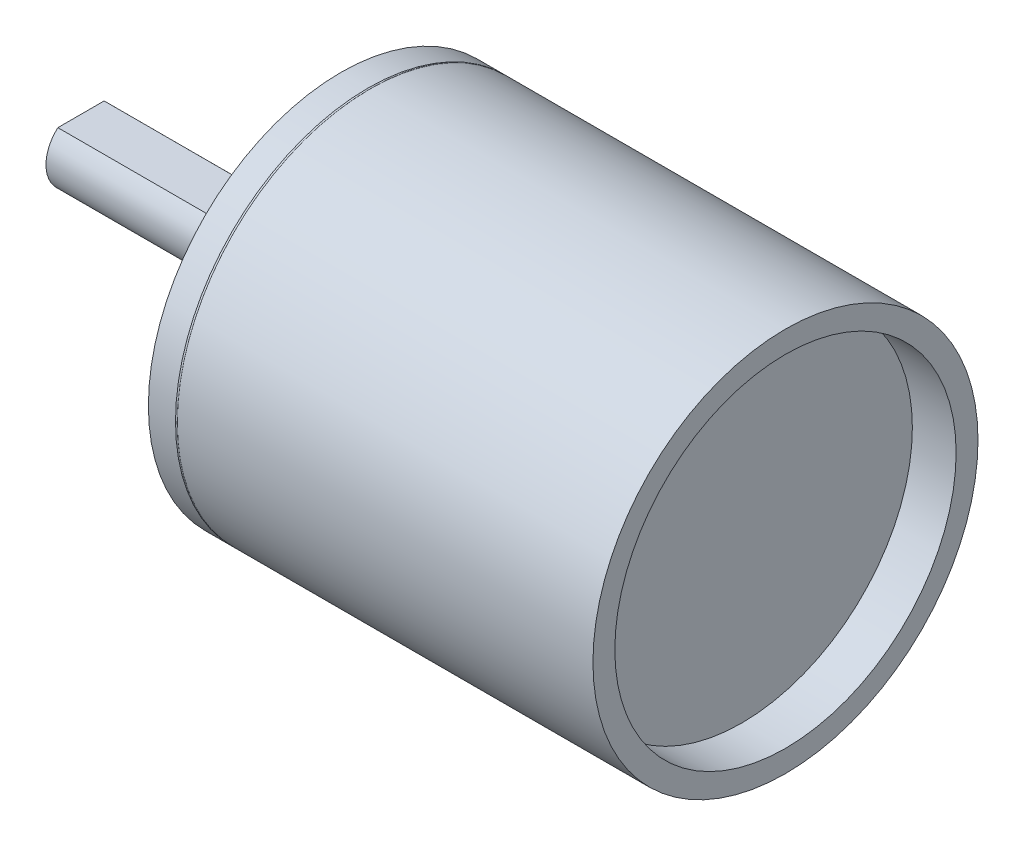
ISO-10303-21;
HEADER;
FILE_DESCRIPTION(('STEP AP214'),'2;1');
FILE_NAME('part.step','',(''),(''),'','','');
FILE_SCHEMA(('AUTOMOTIVE_DESIGN { 1 0 10303 214 1 1 1 1 }'));
ENDSEC;
DATA;
#1=APPLICATION_CONTEXT('core data for automotive mechanical design processes');
#2=APPLICATION_PROTOCOL_DEFINITION('international standard','automotive_design',2000,#1);
#3=PRODUCT_CONTEXT('',#1,'mechanical');
#4=PRODUCT('Part','Part','',(#3));
#5=PRODUCT_RELATED_PRODUCT_CATEGORY('part','',(#4));
#6=PRODUCT_DEFINITION_FORMATION('','',#4);
#7=PRODUCT_DEFINITION_CONTEXT('part definition',#1,'design');
#8=PRODUCT_DEFINITION('design','',#6,#7);
#9=PRODUCT_DEFINITION_SHAPE('','',#8);
#10=(LENGTH_UNIT() NAMED_UNIT(*) SI_UNIT(.MILLI.,.METRE.));
#11=(NAMED_UNIT(*) PLANE_ANGLE_UNIT() SI_UNIT($,.RADIAN.));
#12=(NAMED_UNIT(*) SI_UNIT($,.STERADIAN.) SOLID_ANGLE_UNIT());
#13=UNCERTAINTY_MEASURE_WITH_UNIT(LENGTH_MEASURE(1.E-05),#10,'distance_accuracy_value','');
#14=(GEOMETRIC_REPRESENTATION_CONTEXT(3) GLOBAL_UNCERTAINTY_ASSIGNED_CONTEXT((#13)) GLOBAL_UNIT_ASSIGNED_CONTEXT((#10,
#11,#12)) REPRESENTATION_CONTEXT('',''));
#15=CARTESIAN_POINT('',(0.,0.,0.));
#16=DIRECTION('',(0.,0.,1.));
#17=DIRECTION('',(1.,0.,0.));
#18=AXIS2_PLACEMENT_3D('',#15,#16,#17);
#19=CARTESIAN_POINT('',(-5.304325681522,1.750000002747,0.));
#20=DIRECTION('',(0.713250449154662,-0.700909264299362,0.));
#21=DIRECTION('',(0.700909264299362,0.713250449154662,0.));
#22=AXIS2_PLACEMENT_3D('',#19,#20,#21);
#23=PLANE('',#22);
#24=DIRECTION('',(0.,0.,1.));
#25=VECTOR('',#24,1.);
#26=CARTESIAN_POINT('',(-5.55,1.5,0.));
#27=LINE('',#26,#25);
#28=CARTESIAN_POINT('',(-5.54999999999996,1.50000000000007,1.3228756555322));
#29=VERTEX_POINT('',#28);
#30=CARTESIAN_POINT('',(-5.54999999999996,1.50000000000007,-1.3228756555322));
#31=VERTEX_POINT('',#30);
#32=EDGE_CURVE('P0_E70',#29,#31,#27,.F.);
#33=ORIENTED_EDGE('',*,*,#32,.F.);
#34=CARTESIAN_POINT('',(-7.02404589467157,0.,0.));
#35=DIRECTION('',(0.713250449154662,-0.700909264299362,0.));
#36=DIRECTION('',(0.700909264299362,0.713250449154662,0.));
#37=AXIS2_PLACEMENT_3D('',#34,#35,#36);
#38=ELLIPSE('',#37,2.80406412974627,2.);
#39=EDGE_CURVE('P0_E19',#31,#29,#38,.T.);
#40=ORIENTED_EDGE('',*,*,#39,.F.);
#41=EDGE_LOOP('',(#33,#40));
#42=FACE_BOUND('',#41,.T.);
#43=ADVANCED_FACE('P0_F16',(#42),#23,.F.);
#44=CARTESIAN_POINT('',(-14.85,-0.25,1.684082062692E-07));
#45=DIRECTION('',(1.,0.,0.));
#46=DIRECTION('',(0.,0.,-1.));
#47=AXIS2_PLACEMENT_3D('',#44,#45,#46);
#48=PLANE('',#47);
#49=CARTESIAN_POINT('',(-14.85,0.,0.));
#50=DIRECTION('',(1.,0.,0.));
#51=DIRECTION('',(0.,0.,-1.));
#52=AXIS2_PLACEMENT_3D('',#49,#50,#51);
#53=CIRCLE('',#52,2.);
#54=CARTESIAN_POINT('',(-14.85,1.50000000000007,1.32287565553221));
#55=VERTEX_POINT('',#54);
#56=CARTESIAN_POINT('',(-14.85,1.50000000000007,-1.32287565553221));
#57=VERTEX_POINT('',#56);
#58=EDGE_CURVE('P0_E59',#55,#57,#53,.T.);
#59=ORIENTED_EDGE('',*,*,#58,.F.);
#60=DIRECTION('',(0.,0.,1.));
#61=VECTOR('',#60,1.);
#62=CARTESIAN_POINT('',(-14.85,1.5,0.));
#63=LINE('',#62,#61);
#64=EDGE_CURVE('P0_E62',#57,#55,#63,.T.);
#65=ORIENTED_EDGE('',*,*,#64,.F.);
#66=EDGE_LOOP('',(#59,#65));
#67=FACE_BOUND('',#66,.T.);
#68=ADVANCED_FACE('P0_F61',(#67),#48,.F.);
#69=CARTESIAN_POINT('',(-10.2,1.5,0.));
#70=DIRECTION('',(0.,1.,0.));
#71=DIRECTION('',(0.,0.,1.));
#72=AXIS2_PLACEMENT_3D('',#69,#70,#71);
#73=PLANE('',#72);
#74=ORIENTED_EDGE('',*,*,#64,.T.);
#75=DIRECTION('',(1.,0.,0.));
#76=VECTOR('',#75,1.);
#77=CARTESIAN_POINT('',(-14.85,1.50000000000015,1.32287565553213));
#78=LINE('',#77,#76);
#79=EDGE_CURVE('P0_E69',#29,#55,#78,.F.);
#80=ORIENTED_EDGE('',*,*,#79,.F.);
#81=ORIENTED_EDGE('',*,*,#32,.T.);
#82=DIRECTION('',(1.,0.,0.));
#83=VECTOR('',#82,1.);
#84=CARTESIAN_POINT('',(-14.85,1.50000000000015,-1.32287565553213));
#85=LINE('',#84,#83);
#86=EDGE_CURVE('P0_E64',#57,#31,#85,.T.);
#87=ORIENTED_EDGE('',*,*,#86,.F.);
#88=EDGE_LOOP('',(#74,#80,#81,#87));
#89=FACE_BOUND('',#88,.T.);
#90=ADVANCED_FACE('P0_F67',(#89),#73,.T.);
#91=CARTESIAN_POINT('',(-14.85,0.,0.));
#92=DIRECTION('',(1.,0.,0.));
#93=DIRECTION('',(0.,0.,-1.));
#94=AXIS2_PLACEMENT_3D('',#91,#92,#93);
#95=CYLINDRICAL_SURFACE('',#94,2.);
#96=CARTESIAN_POINT('',(-3.15,0.,0.));
#97=DIRECTION('',(1.,0.,0.));
#98=DIRECTION('',(0.,0.,-1.));
#99=AXIS2_PLACEMENT_3D('',#96,#97,#98);
#100=CIRCLE('',#99,2.);
#101=CARTESIAN_POINT('',(-3.15,0.,-2.));
#102=VERTEX_POINT('',#101);
#103=EDGE_CURVE('P0_E114',#102,#102,#100,.F.);
#104=ORIENTED_EDGE('',*,*,#103,.T.);
#105=EDGE_LOOP('',(#104));
#106=FACE_BOUND('',#105,.T.);
#107=ORIENTED_EDGE('',*,*,#58,.T.);
#108=ORIENTED_EDGE('',*,*,#86,.T.);
#109=ORIENTED_EDGE('',*,*,#39,.T.);
#110=ORIENTED_EDGE('',*,*,#79,.T.);
#111=EDGE_LOOP('',(#107,#108,#109,#110));
#112=FACE_BOUND('',#111,.T.);
#113=ADVANCED_FACE('P0_F72',(#106,#112),#95,.T.);
#114=CARTESIAN_POINT('',(-3.15,0.,0.));
#115=DIRECTION('',(1.,0.,0.));
#116=DIRECTION('',(0.,0.,-1.));
#117=AXIS2_PLACEMENT_3D('',#114,#115,#116);
#118=PLANE('',#117);
#119=ORIENTED_EDGE('',*,*,#103,.F.);
#120=EDGE_LOOP('',(#119));
#121=FACE_BOUND('',#120,.T.);
#122=CARTESIAN_POINT('',(-3.15,0.,0.));
#123=DIRECTION('',(1.,0.,0.));
#124=DIRECTION('',(0.,0.,-1.));
#125=AXIS2_PLACEMENT_3D('',#122,#123,#124);
#126=CIRCLE('',#125,3.5);
#127=CARTESIAN_POINT('',(-3.15,0.,-3.5));
#128=VERTEX_POINT('',#127);
#129=EDGE_CURVE('P0_E111',#128,#128,#126,.T.);
#130=ORIENTED_EDGE('',*,*,#129,.F.);
#131=EDGE_LOOP('',(#130));
#132=FACE_BOUND('',#131,.T.);
#133=ADVANCED_FACE('P0_F119',(#121,#132),#118,.F.);
#134=CARTESIAN_POINT('',(-3.15,0.,0.));
#135=DIRECTION('',(1.,0.,0.));
#136=DIRECTION('',(0.,0.,-1.));
#137=AXIS2_PLACEMENT_3D('',#134,#135,#136);
#138=CYLINDRICAL_SURFACE('',#137,3.5);
#139=ORIENTED_EDGE('',*,*,#129,.T.);
#140=EDGE_LOOP('',(#139));
#141=FACE_BOUND('',#140,.T.);
#142=CARTESIAN_POINT('',(-1.35,0.,0.));
#143=DIRECTION('',(1.,0.,0.));
#144=DIRECTION('',(0.,0.,-1.));
#145=AXIS2_PLACEMENT_3D('',#142,#143,#144);
#146=CIRCLE('',#145,3.5);
#147=CARTESIAN_POINT('',(-1.35,0.,-3.5));
#148=VERTEX_POINT('',#147);
#149=EDGE_CURVE('P0_E108',#148,#148,#146,.F.);
#150=ORIENTED_EDGE('',*,*,#149,.T.);
#151=EDGE_LOOP('',(#150));
#152=FACE_BOUND('',#151,.T.);
#153=ADVANCED_FACE('P0_F122',(#141,#152),#138,.T.);
#154=CARTESIAN_POINT('',(-1.35,0.,0.));
#155=DIRECTION('',(1.,0.,0.));
#156=DIRECTION('',(0.,0.,-1.));
#157=AXIS2_PLACEMENT_3D('',#154,#155,#156);
#158=PLANE('',#157);
#159=ORIENTED_EDGE('',*,*,#149,.F.);
#160=EDGE_LOOP('',(#159));
#161=FACE_BOUND('',#160,.T.);
#162=CARTESIAN_POINT('',(-1.35,0.,0.));
#163=DIRECTION('',(1.,0.,0.));
#164=DIRECTION('',(0.,0.,-1.));
#165=AXIS2_PLACEMENT_3D('',#162,#163,#164);
#166=CIRCLE('',#165,5.);
#167=CARTESIAN_POINT('',(-1.35,0.,-5.));
#168=VERTEX_POINT('',#167);
#169=EDGE_CURVE('P0_E103',#168,#168,#166,.T.);
#170=ORIENTED_EDGE('',*,*,#169,.F.);
#171=EDGE_LOOP('',(#170));
#172=FACE_BOUND('',#171,.T.);
#173=ADVANCED_FACE('P0_F128',(#161,#172),#158,.F.);
#174=CARTESIAN_POINT('',(4.0000000000191,6.999999999989,1.221730476395E-05));
#175=DIRECTION('',(-1.,0.,0.));
#176=DIRECTION('',(0.,0.,1.));
#177=AXIS2_PLACEMENT_3D('',#174,#175,#176);
#178=CONICAL_SURFACE('',#177,1.02499999981555,1.02974425851489);
#179=CARTESIAN_POINT('',(4.,6.999999999989,1.221730476395E-05));
#180=DIRECTION('',(-1.,0.,0.));
#181=DIRECTION('',(0.,0.,1.));
#182=AXIS2_PLACEMENT_3D('',#179,#180,#181);
#183=CIRCLE('',#182,1.025);
#184=CARTESIAN_POINT('',(4.,6.999999999989,1.02501221730476));
#185=VERTEX_POINT('',#184);
#186=EDGE_CURVE('P0_E106',#185,#185,#183,.T.);
#187=ORIENTED_EDGE('',*,*,#186,.T.);
#188=EDGE_LOOP('',(#187));
#189=FACE_BOUND('',#188,.T.);
#190=CARTESIAN_POINT('',(4.61588213448749,7.00000000006185,1.221730476395E-05));
#191=VERTEX_POINT('',#190);
#192=VERTEX_LOOP('',#191);
#193=FACE_BOUND('',#192,.T.);
#194=ADVANCED_FACE('P0_F134',(#189,#193),#178,.F.);
#195=CARTESIAN_POINT('',(3.99999999996226,-3.500010580491,6.062171717829));
#196=DIRECTION('',(-1.,0.,0.));
#197=DIRECTION('',(0.,0.,1.));
#198=AXIS2_PLACEMENT_3D('',#195,#196,#197);
#199=CONICAL_SURFACE('',#198,1.02499999994784,1.02974425865799);
#200=CARTESIAN_POINT('',(3.99999999990541,-2.98751058050285,5.17449567897052));
#201=CARTESIAN_POINT('',(4.02566175549754,-3.00886473888174,5.21148218541788));
#202=CARTESIAN_POINT('',(4.05132351111989,-3.03021889832285,5.24846869123101));
#203=CARTESIAN_POINT('',(4.1026470223646,-3.07292721927441,5.32244170162462));
#204=CARTESIAN_POINT('',(4.12830877798695,-3.09428138078487,5.35942820620511));
#205=CARTESIAN_POINT('',(4.17963228919821,-3.13698970584252,5.43340121420825));
#206=CARTESIAN_POINT('',(4.20529404478713,-3.15834386938971,5.47038771763089));
#207=CARTESIAN_POINT('',(4.25661755597447,-3.20105219856139,5.54436072327025));
#208=CARTESIAN_POINT('',(4.2822793115729,-3.22240636418587,5.58134722548696));
#209=CARTESIAN_POINT('',(4.33360282277961,-3.26511469751708,5.65532022875441));
#210=CARTESIAN_POINT('',(4.35926457838788,-3.2864688652238,5.69230672980515));
#211=CARTESIAN_POINT('',(4.41058808962184,-3.32917720272132,5.76627973065341));
#212=CARTESIAN_POINT('',(4.43624984524753,-3.35053137251211,5.80326623045093));
#213=CARTESIAN_POINT('',(4.48757335646287,-3.39323971412742,5.87723922889167));
#214=CARTESIAN_POINT('',(4.51323511205252,-3.41459388595195,5.91422572753488));
#215=CARTESIAN_POINT('',(4.56455862325077,-3.45730223168929,5.98819872364552));
#216=CARTESIAN_POINT('',(4.59022037885936,-3.4786564056021,6.02518522111294));
#217=CARTESIAN_POINT('',(4.61588213448749,-3.50001058057184,6.0621717179566));
#218=B_SPLINE_CURVE_WITH_KNOTS('',3,(#200,#201,#202,#203,#204,#205,#206,#207,#208,#209,#210,
#211,#212,#213,#214,#215,#216,#217),.UNSPECIFIED.,.F.,.F.,(4,2,2,2,2,2,2,2,4),(0.,
0.149474904093955,0.298949808103517,0.448424712101636,0.597899616099755,0.747374520193708,
0.896849424203269,1.04632432820139,1.19579923229534),.UNSPECIFIED.);
#219=CARTESIAN_POINT('',(3.99999999997635,-2.98751058049379,5.17449567895433));
#220=VERTEX_POINT('',#219);
#221=CARTESIAN_POINT('',(4.61588213448749,-3.500010580491,6.062171717829));
#222=VERTEX_POINT('',#221);
#223=EDGE_CURVE('P0_E107',#220,#222,#218,.T.);
#224=ORIENTED_EDGE('',*,*,#223,.T.);
#225=DIRECTION('',(0.515038074909772,0.428583650350787,-0.742328657701715));
#226=VECTOR('',#225,1.);
#227=CARTESIAN_POINT('',(-346204.404158143,-288097.784339413,499000.));
#228=LINE('',#227,#226);
#229=CARTESIAN_POINT('',(3.99999999999056,-4.01251058047455,6.94984775668915));
#230=VERTEX_POINT('',#229);
#231=EDGE_CURVE('P0_E34',#222,#230,#228,.F.);
#232=ORIENTED_EDGE('',*,*,#231,.T.);
#233=CARTESIAN_POINT('',(4.,-3.500010580491,6.062171717829));
#234=DIRECTION('',(-1.,0.,0.));
#235=DIRECTION('',(0.,0.,1.));
#236=AXIS2_PLACEMENT_3D('',#233,#234,#235);
#237=CIRCLE('',#236,1.025000000001);
#238=EDGE_CURVE('P0_E169',#230,#220,#237,.T.);
#239=ORIENTED_EDGE('',*,*,#238,.T.);
#240=EDGE_LOOP('',(#224,#232,#239));
#241=FACE_BOUND('',#240,.T.);
#242=ADVANCED_FACE('P0_F250',(#241),#199,.F.);
#243=CARTESIAN_POINT('',(3.99999999996226,-3.500010580491,6.062171717829));
#244=DIRECTION('',(-1.,0.,0.));
#245=DIRECTION('',(0.,0.,1.));
#246=AXIS2_PLACEMENT_3D('',#243,#244,#245);
#247=CONICAL_SURFACE('',#246,1.02499999989861,1.02974425855217);
#248=CARTESIAN_POINT('',(4.,-3.500010580491,6.062171717829));
#249=DIRECTION('',(-1.,0.,0.));
#250=DIRECTION('',(0.,0.,1.));
#251=AXIS2_PLACEMENT_3D('',#248,#249,#250);
#252=CIRCLE('',#251,1.025000000001);
#253=EDGE_CURVE('P0_E168',#220,#230,#252,.T.);
#254=ORIENTED_EDGE('',*,*,#253,.T.);
#255=ORIENTED_EDGE('',*,*,#231,.F.);
#256=ORIENTED_EDGE('',*,*,#223,.F.);
#257=EDGE_LOOP('',(#254,#255,#256));
#258=FACE_BOUND('',#257,.T.);
#259=ADVANCED_FACE('P0_F183',(#258),#247,.F.);
#260=CARTESIAN_POINT('',(3.99999999996226,-3.499989419498,-6.062183935134));
#261=DIRECTION('',(-1.,0.,0.));
#262=DIRECTION('',(0.,0.,1.));
#263=AXIS2_PLACEMENT_3D('',#260,#261,#262);
#264=CONICAL_SURFACE('',#263,1.02500000002402,1.02974425869443);
#265=CARTESIAN_POINT('',(4.,-3.499989419498,-6.062183935134));
#266=DIRECTION('',(-1.,0.,0.));
#267=DIRECTION('',(0.,0.,1.));
#268=AXIS2_PLACEMENT_3D('',#265,#266,#267);
#269=CIRCLE('',#268,1.025);
#270=CARTESIAN_POINT('',(4.,-3.499989419498,-5.037183935134));
#271=VERTEX_POINT('',#270);
#272=EDGE_CURVE('P0_E102',#271,#271,#269,.T.);
#273=ORIENTED_EDGE('',*,*,#272,.T.);
#274=EDGE_LOOP('',(#273));
#275=FACE_BOUND('',#274,.T.);
#276=CARTESIAN_POINT('',(4.61588213443065,-3.499989419498,-6.062183935134));
#277=VERTEX_POINT('',#276);
#278=VERTEX_LOOP('',#277);
#279=FACE_BOUND('',#278,.T.);
#280=ADVANCED_FACE('P0_F142',(#275,#279),#264,.F.);
#281=CARTESIAN_POINT('',(-1.35,0.,0.));
#282=DIRECTION('',(1.,0.,0.));
#283=DIRECTION('',(0.,0.,-1.));
#284=AXIS2_PLACEMENT_3D('',#281,#282,#283);
#285=CYLINDRICAL_SURFACE('',#284,5.);
#286=ORIENTED_EDGE('',*,*,#169,.T.);
#287=EDGE_LOOP('',(#286));
#288=FACE_BOUND('',#287,.T.);
#289=CARTESIAN_POINT('',(0.,0.,0.));
#290=DIRECTION('',(1.,0.,0.));
#291=DIRECTION('',(0.,0.,-1.));
#292=AXIS2_PLACEMENT_3D('',#289,#290,#291);
#293=CIRCLE('',#292,5.);
#294=CARTESIAN_POINT('',(0.,0.,-5.));
#295=VERTEX_POINT('',#294);
#296=EDGE_CURVE('P0_E99',#295,#295,#293,.F.);
#297=ORIENTED_EDGE('',*,*,#296,.T.);
#298=EDGE_LOOP('',(#297));
#299=FACE_BOUND('',#298,.T.);
#300=ADVANCED_FACE('P0_F138',(#288,#299),#285,.T.);
#301=CARTESIAN_POINT('',(4.,6.999999999989,1.221730476395E-05));
#302=DIRECTION('',(-1.,0.,0.));
#303=DIRECTION('',(0.,0.,1.));
#304=AXIS2_PLACEMENT_3D('',#301,#302,#303);
#305=CYLINDRICAL_SURFACE('',#304,1.025);
#306=ORIENTED_EDGE('',*,*,#186,.F.);
#307=EDGE_LOOP('',(#306));
#308=FACE_BOUND('',#307,.T.);
#309=CARTESIAN_POINT('',(0.,6.999999999989,1.221730476395E-05));
#310=DIRECTION('',(-1.,0.,0.));
#311=DIRECTION('',(0.,0.,1.));
#312=AXIS2_PLACEMENT_3D('',#309,#310,#311);
#313=CIRCLE('',#312,1.025);
#314=CARTESIAN_POINT('',(0.,6.999999999989,1.02501221730476));
#315=VERTEX_POINT('',#314);
#316=EDGE_CURVE('P0_E96',#315,#315,#313,.T.);
#317=ORIENTED_EDGE('',*,*,#316,.T.);
#318=EDGE_LOOP('',(#317));
#319=FACE_BOUND('',#318,.T.);
#320=ADVANCED_FACE('P0_F141',(#308,#319),#305,.F.);
#321=CARTESIAN_POINT('',(4.,-3.500010580491,6.062171717829));
#322=DIRECTION('',(-1.,0.,0.));
#323=DIRECTION('',(0.,0.,1.));
#324=AXIS2_PLACEMENT_3D('',#321,#322,#323);
#325=CYLINDRICAL_SURFACE('',#324,1.025000000001);
#326=ORIENTED_EDGE('',*,*,#253,.F.);
#327=ORIENTED_EDGE('',*,*,#238,.F.);
#328=EDGE_LOOP('',(#326,#327));
#329=FACE_BOUND('',#328,.T.);
#330=CARTESIAN_POINT('',(0.,-3.500010580491,6.062171717829));
#331=DIRECTION('',(-1.,0.,0.));
#332=DIRECTION('',(0.,0.,1.));
#333=AXIS2_PLACEMENT_3D('',#330,#331,#332);
#334=CIRCLE('',#333,1.025000000001);
#335=CARTESIAN_POINT('',(0.,-3.500010580491,7.08717171783));
#336=VERTEX_POINT('',#335);
#337=EDGE_CURVE('P0_E93',#336,#336,#334,.T.);
#338=ORIENTED_EDGE('',*,*,#337,.T.);
#339=EDGE_LOOP('',(#338));
#340=FACE_BOUND('',#339,.T.);
#341=ADVANCED_FACE('P0_F201',(#329,#340),#325,.F.);
#342=CARTESIAN_POINT('',(4.,-3.499989419498,-6.062183935134));
#343=DIRECTION('',(-1.,0.,0.));
#344=DIRECTION('',(0.,0.,1.));
#345=AXIS2_PLACEMENT_3D('',#342,#343,#344);
#346=CYLINDRICAL_SURFACE('',#345,1.025);
#347=ORIENTED_EDGE('',*,*,#272,.F.);
#348=EDGE_LOOP('',(#347));
#349=FACE_BOUND('',#348,.T.);
#350=CARTESIAN_POINT('',(0.,-3.499989419498,-6.062183935134));
#351=DIRECTION('',(-1.,0.,0.));
#352=DIRECTION('',(0.,0.,1.));
#353=AXIS2_PLACEMENT_3D('',#350,#351,#352);
#354=CIRCLE('',#353,1.025);
#355=CARTESIAN_POINT('',(0.,-3.499989419498,-5.037183935134));
#356=VERTEX_POINT('',#355);
#357=EDGE_CURVE('P0_E90',#356,#356,#354,.T.);
#358=ORIENTED_EDGE('',*,*,#357,.T.);
#359=EDGE_LOOP('',(#358));
#360=FACE_BOUND('',#359,.T.);
#361=ADVANCED_FACE('P0_F209',(#349,#360),#346,.F.);
#362=CARTESIAN_POINT('',(22.9,0.,0.));
#363=DIRECTION('',(1.,0.,0.));
#364=DIRECTION('',(0.,0.,-1.));
#365=AXIS2_PLACEMENT_3D('',#362,#363,#364);
#366=PLANE('',#365);
#367=CARTESIAN_POINT('',(22.9,0.,0.));
#368=DIRECTION('',(1.,0.,0.));
#369=DIRECTION('',(0.,0.,-1.));
#370=AXIS2_PLACEMENT_3D('',#367,#368,#369);
#371=CIRCLE('',#370,9.75);
#372=CARTESIAN_POINT('',(22.9,0.,-9.75));
#373=VERTEX_POINT('',#372);
#374=EDGE_CURVE('P0_E87',#373,#373,#371,.T.);
#375=ORIENTED_EDGE('',*,*,#374,.T.);
#376=EDGE_LOOP('',(#375));
#377=FACE_BOUND('',#376,.T.);
#378=ADVANCED_FACE('P0_F150',(#377),#366,.T.);
#379=CARTESIAN_POINT('',(0.,0.,0.));
#380=DIRECTION('',(1.,0.,0.));
#381=DIRECTION('',(0.,0.,-1.));
#382=AXIS2_PLACEMENT_3D('',#379,#380,#381);
#383=PLANE('',#382);
#384=ORIENTED_EDGE('',*,*,#357,.F.);
#385=EDGE_LOOP('',(#384));
#386=FACE_BOUND('',#385,.T.);
#387=ORIENTED_EDGE('',*,*,#337,.F.);
#388=EDGE_LOOP('',(#387));
#389=FACE_BOUND('',#388,.T.);
#390=ORIENTED_EDGE('',*,*,#316,.F.);
#391=EDGE_LOOP('',(#390));
#392=FACE_BOUND('',#391,.T.);
#393=ORIENTED_EDGE('',*,*,#296,.F.);
#394=EDGE_LOOP('',(#393));
#395=FACE_BOUND('',#394,.T.);
#396=CARTESIAN_POINT('',(0.,0.,0.));
#397=DIRECTION('',(1.,0.,0.));
#398=DIRECTION('',(0.,0.,-1.));
#399=AXIS2_PLACEMENT_3D('',#396,#397,#398);
#400=CIRCLE('',#399,11.);
#401=CARTESIAN_POINT('',(0.,0.,-11.));
#402=VERTEX_POINT('',#401);
#403=EDGE_CURVE('P0_E84',#402,#402,#400,.T.);
#404=ORIENTED_EDGE('',*,*,#403,.F.);
#405=EDGE_LOOP('',(#404));
#406=FACE_BOUND('',#405,.T.);
#407=ADVANCED_FACE('P0_F146',(#386,#389,#392,#395,#406),#383,.F.);
#408=CARTESIAN_POINT('',(22.9,0.,0.));
#409=DIRECTION('',(1.,0.,0.));
#410=DIRECTION('',(0.,0.,-1.));
#411=AXIS2_PLACEMENT_3D('',#408,#409,#410);
#412=CYLINDRICAL_SURFACE('',#411,9.75);
#413=ORIENTED_EDGE('',*,*,#374,.F.);
#414=EDGE_LOOP('',(#413));
#415=FACE_BOUND('',#414,.T.);
#416=CARTESIAN_POINT('',(25.4,0.,0.));
#417=DIRECTION('',(1.,0.,0.));
#418=DIRECTION('',(0.,0.,-1.));
#419=AXIS2_PLACEMENT_3D('',#416,#417,#418);
#420=CIRCLE('',#419,9.75);
#421=CARTESIAN_POINT('',(25.4,0.,-9.75));
#422=VERTEX_POINT('',#421);
#423=EDGE_CURVE('P0_E81',#422,#422,#420,.F.);
#424=ORIENTED_EDGE('',*,*,#423,.F.);
#425=EDGE_LOOP('',(#424));
#426=FACE_BOUND('',#425,.T.);
#427=ADVANCED_FACE('P0_F149',(#415,#426),#412,.F.);
#428=CARTESIAN_POINT('',(0.,0.,0.));
#429=DIRECTION('',(1.,0.,0.));
#430=DIRECTION('',(0.,0.,-1.));
#431=AXIS2_PLACEMENT_3D('',#428,#429,#430);
#432=CYLINDRICAL_SURFACE('',#431,11.);
#433=ORIENTED_EDGE('',*,*,#403,.T.);
#434=EDGE_LOOP('',(#433));
#435=FACE_BOUND('',#434,.T.);
#436=CARTESIAN_POINT('',(1.55000000000067,0.,0.));
#437=DIRECTION('',(1.,0.,0.));
#438=DIRECTION('',(0.,-1.,0.));
#439=AXIS2_PLACEMENT_3D('',#436,#437,#438);
#440=CIRCLE('',#439,11.0000000000012);
#441=CARTESIAN_POINT('',(1.55000000000067,-11.0000000000012,0.));
#442=VERTEX_POINT('',#441);
#443=EDGE_CURVE('P0_E80',#442,#442,#440,.F.);
#444=ORIENTED_EDGE('',*,*,#443,.T.);
#445=EDGE_LOOP('',(#444));
#446=FACE_BOUND('',#445,.T.);
#447=ADVANCED_FACE('P0_F155',(#435,#446),#432,.T.);
#448=CARTESIAN_POINT('',(25.4,0.,0.));
#449=DIRECTION('',(1.,0.,0.));
#450=DIRECTION('',(0.,0.,-1.));
#451=AXIS2_PLACEMENT_3D('',#448,#449,#450);
#452=PLANE('',#451);
#453=ORIENTED_EDGE('',*,*,#423,.T.);
#454=EDGE_LOOP('',(#453));
#455=FACE_BOUND('',#454,.T.);
#456=CARTESIAN_POINT('',(25.4,0.,0.));
#457=DIRECTION('',(1.,0.,0.));
#458=DIRECTION('',(0.,0.,-1.));
#459=AXIS2_PLACEMENT_3D('',#456,#457,#458);
#460=CIRCLE('',#459,11.);
#461=CARTESIAN_POINT('',(25.4,0.,-11.));
#462=VERTEX_POINT('',#461);
#463=EDGE_CURVE('P0_E25',#462,#462,#460,.F.);
#464=ORIENTED_EDGE('',*,*,#463,.F.);
#465=EDGE_LOOP('',(#464));
#466=FACE_BOUND('',#465,.T.);
#467=ADVANCED_FACE('P0_F158',(#455,#466),#452,.T.);
#468=CARTESIAN_POINT('',(1.6,0.,0.));
#469=DIRECTION('',(1.,0.,0.));
#470=DIRECTION('',(0.,-1.,0.));
#471=AXIS2_PLACEMENT_3D('',#468,#469,#470);
#472=TOROIDAL_SURFACE('',#471,11.08660254038,0.1);
#473=ORIENTED_EDGE('',*,*,#443,.F.);
#474=EDGE_LOOP('',(#473));
#475=FACE_BOUND('',#474,.T.);
#476=CARTESIAN_POINT('',(1.65,0.,0.));
#477=DIRECTION('',(1.,0.,0.));
#478=DIRECTION('',(0.,0.,-1.));
#479=AXIS2_PLACEMENT_3D('',#476,#477,#478);
#480=CIRCLE('',#479,11.);
#481=CARTESIAN_POINT('',(1.65,0.,-11.));
#482=VERTEX_POINT('',#481);
#483=EDGE_CURVE('P0_E11',#482,#482,#480,.T.);
#484=ORIENTED_EDGE('',*,*,#483,.F.);
#485=EDGE_LOOP('',(#484));
#486=FACE_BOUND('',#485,.T.);
#487=ADVANCED_FACE('P0_F214',(#475,#486),#472,.F.);
#488=CARTESIAN_POINT('',(0.,0.,0.));
#489=DIRECTION('',(1.,0.,0.));
#490=DIRECTION('',(0.,0.,-1.));
#491=AXIS2_PLACEMENT_3D('',#488,#489,#490);
#492=CYLINDRICAL_SURFACE('',#491,11.);
#493=ORIENTED_EDGE('',*,*,#463,.T.);
#494=EDGE_LOOP('',(#493));
#495=FACE_BOUND('',#494,.T.);
#496=ORIENTED_EDGE('',*,*,#483,.T.);
#497=EDGE_LOOP('',(#496));
#498=FACE_BOUND('',#497,.T.);
#499=ADVANCED_FACE('P0_F212',(#495,#498),#492,.T.);
#500=CLOSED_SHELL('',(#43,#68,#90,#113,#133,#153,#173,#194,#242,#259,#280,#300,#320,#341,#361,
#378,#407,#427,#447,#467,#487,#499));
#501=MANIFOLD_SOLID_BREP('P0_B1',#500);
#502=CARTESIAN_POINT('',(3.9,6.999999999989,1.221730476395E-05));
#503=DIRECTION('',(-1.,0.,0.));
#504=DIRECTION('',(0.,0.,1.));
#505=AXIS2_PLACEMENT_3D('',#502,#503,#504);
#506=CYLINDRICAL_SURFACE('',#505,1.25);
#507=CARTESIAN_POINT('',(3.9,6.999999999989,1.221730476395E-05));
#508=DIRECTION('',(-1.,0.,0.));
#509=DIRECTION('',(0.,0.,1.));
#510=AXIS2_PLACEMENT_3D('',#507,#508,#509);
#511=CIRCLE('',#510,1.25);
#512=CARTESIAN_POINT('',(3.9,6.999999999989,1.25001221730476));
#513=VERTEX_POINT('',#512);
#514=EDGE_CURVE('P1_E11',#513,#513,#511,.T.);
#515=ORIENTED_EDGE('',*,*,#514,.T.);
#516=EDGE_LOOP('',(#515));
#517=FACE_BOUND('',#516,.T.);
#518=CARTESIAN_POINT('',(0.,6.999999999989,1.221730476395E-05));
#519=DIRECTION('',(-1.,0.,0.));
#520=DIRECTION('',(0.,0.,1.));
#521=AXIS2_PLACEMENT_3D('',#518,#519,#520);
#522=CIRCLE('',#521,1.25);
#523=CARTESIAN_POINT('',(0.,6.999999999989,1.25001221730476));
#524=VERTEX_POINT('',#523);
#525=EDGE_CURVE('P1_E23',#524,#524,#522,.F.);
#526=ORIENTED_EDGE('',*,*,#525,.T.);
#527=EDGE_LOOP('',(#526));
#528=FACE_BOUND('',#527,.T.);
#529=ADVANCED_FACE('P1_F16',(#517,#528),#506,.T.);
#530=CARTESIAN_POINT('',(3.9,6.999999999989,1.221730476364E-05));
#531=DIRECTION('',(1.,0.,0.));
#532=DIRECTION('',(0.,0.,-1.));
#533=AXIS2_PLACEMENT_3D('',#530,#531,#532);
#534=PLANE('',#533);
#535=CARTESIAN_POINT('',(3.9,8.024999999989,1.221730476386E-05));
#536=CARTESIAN_POINT('',(3.9,8.02385783770784,-0.20658324030408));
#537=CARTESIAN_POINT('',(3.9,7.94663980673409,-0.39289793221752));
#538=CARTESIAN_POINT('',(3.9,7.86879966045055,-0.58071368833601));
#539=CARTESIAN_POINT('',(3.9,7.72429001920784,-0.725261430728882));
#540=CARTESIAN_POINT('',(3.9,7.58176906531624,-0.867819961436941));
#541=CARTESIAN_POINT('',(3.9,7.39418807755779,-0.94609873393043));
#542=CARTESIAN_POINT('',(3.9,7.20735483346087,-1.02406546810562));
#543=CARTESIAN_POINT('',(3.9,7.0040325312465,-1.02497391422067));
#544=CARTESIAN_POINT('',(3.9,6.80191499624577,-1.02587697742355));
#545=CARTESIAN_POINT('',(3.9,6.61353792290775,-0.949297888895742));
#546=CARTESIAN_POINT('',(3.9,6.42535409452807,-0.872797358350123));
#547=CARTESIAN_POINT('',(3.9,6.28018718094833,-0.72970396264077));
#548=CARTESIAN_POINT('',(3.9,6.13391281017504,-0.58551892830303));
#549=CARTESIAN_POINT('',(3.9,6.05421373235404,-0.394861817230703));
#550=CARTESIAN_POINT('',(3.9,5.97586390194588,-0.2074323923611));
#551=CARTESIAN_POINT('',(3.9,5.974999999989,1.221730476386E-05));
#552=B_SPLINE_CURVE_WITH_KNOTS('',2,(#535,#536,#537,#538,#539,#540,#541,#542,#543,#544,#545,
#546,#547,#548,#549,#550,#551),.UNSPECIFIED.,.F.,.F.,(3,2,2,2,2,2,2,2,3),(0.,0.125,0.25,0.375,
0.5,0.625,0.75,0.875,1.),.UNSPECIFIED.);
#553=CARTESIAN_POINT('',(3.9,8.024999999989,1.221730476386E-05));
#554=VERTEX_POINT('',#553);
#555=CARTESIAN_POINT('',(3.9,5.974999999989,1.221730476386E-05));
#556=VERTEX_POINT('',#555);
#557=EDGE_CURVE('P1_E29',#554,#556,#552,.T.);
#558=ORIENTED_EDGE('',*,*,#557,.T.);
#559=CARTESIAN_POINT('',(3.9,5.974999999989,1.221730476386E-05));
#560=CARTESIAN_POINT('',(3.9,5.97614216227016,0.206607674912017));
#561=CARTESIAN_POINT('',(3.9,6.05336019324391,0.392922366827116));
#562=CARTESIAN_POINT('',(3.9,6.13120033952598,0.580738122943736));
#563=CARTESIAN_POINT('',(3.9,6.27570998077016,0.725285865338416));
#564=CARTESIAN_POINT('',(3.9,6.41823093466117,0.86784439604621));
#565=CARTESIAN_POINT('',(3.9,6.60581192242021,0.946123168540227));
#566=CARTESIAN_POINT('',(3.9,6.79264516651724,1.02408990271575));
#567=CARTESIAN_POINT('',(3.9,6.9959674687315,1.0249983488305));
#568=CARTESIAN_POINT('',(3.9,7.19808500373122,1.02590141203309));
#569=CARTESIAN_POINT('',(3.9,7.38646207707025,0.949322323505013));
#570=CARTESIAN_POINT('',(3.9,7.57464590545008,0.87282179295947));
#571=CARTESIAN_POINT('',(3.9,7.71981281902967,0.72972839725027));
#572=CARTESIAN_POINT('',(3.9,7.86608718980465,0.585543362910868));
#573=CARTESIAN_POINT('',(3.9,7.94578626762395,0.394886251840156));
#574=CARTESIAN_POINT('',(3.9,8.02413609803211,0.207456826968179));
#575=CARTESIAN_POINT('',(3.9,8.024999999989,1.221730476386E-05));
#576=B_SPLINE_CURVE_WITH_KNOTS('',2,(#559,#560,#561,#562,#563,#564,#565,#566,#567,#568,#569,
#570,#571,#572,#573,#574,#575),.UNSPECIFIED.,.F.,.F.,(3,2,2,2,2,2,2,2,3),(0.,0.125,0.25,0.375,
0.5,0.625,0.75,0.875,1.),.UNSPECIFIED.);
#577=EDGE_CURVE('P1_E32',#556,#554,#576,.T.);
#578=ORIENTED_EDGE('',*,*,#577,.T.);
#579=EDGE_LOOP('',(#558,#578));
#580=FACE_BOUND('',#579,.T.);
#581=ORIENTED_EDGE('',*,*,#514,.F.);
#582=EDGE_LOOP('',(#581));
#583=FACE_BOUND('',#582,.T.);
#584=ADVANCED_FACE('P1_F17',(#580,#583),#534,.T.);
#585=OPEN_SHELL('',(#529,#584));
#586=SHELL_BASED_SURFACE_MODEL('P1_B1',(#585));
#587=CARTESIAN_POINT('',(3.9,-3.499989419498,-6.062183935134));
#588=DIRECTION('',(-1.,0.,0.));
#589=DIRECTION('',(0.,0.,1.));
#590=AXIS2_PLACEMENT_3D('',#587,#588,#589);
#591=CYLINDRICAL_SURFACE('',#590,1.25);
#592=CARTESIAN_POINT('',(3.9,-3.499989419498,-6.062183935134));
#593=DIRECTION('',(-1.,0.,0.));
#594=DIRECTION('',(0.,0.,1.));
#595=AXIS2_PLACEMENT_3D('',#592,#593,#594);
#596=CIRCLE('',#595,1.25);
#597=CARTESIAN_POINT('',(3.9,-3.499989419498,-4.812183935134));
#598=VERTEX_POINT('',#597);
#599=EDGE_CURVE('P2_E11',#598,#598,#596,.T.);
#600=ORIENTED_EDGE('',*,*,#599,.T.);
#601=EDGE_LOOP('',(#600));
#602=FACE_BOUND('',#601,.T.);
#603=CARTESIAN_POINT('',(0.,-3.499989419498,-6.062183935134));
#604=DIRECTION('',(-1.,0.,0.));
#605=DIRECTION('',(0.,0.,1.));
#606=AXIS2_PLACEMENT_3D('',#603,#604,#605);
#607=CIRCLE('',#606,1.25);
#608=CARTESIAN_POINT('',(0.,-3.499989419498,-4.812183935134));
#609=VERTEX_POINT('',#608);
#610=EDGE_CURVE('P2_E23',#609,#609,#607,.F.);
#611=ORIENTED_EDGE('',*,*,#610,.T.);
#612=EDGE_LOOP('',(#611));
#613=FACE_BOUND('',#612,.T.);
#614=ADVANCED_FACE('P2_F16',(#602,#613),#591,.T.);
#615=CARTESIAN_POINT('',(3.9,-3.499989419498,-6.062183935134));
#616=DIRECTION('',(1.,0.,0.));
#617=DIRECTION('',(0.,0.,-1.));
#618=AXIS2_PLACEMENT_3D('',#615,#616,#617);
#619=PLANE('',#618);
#620=CARTESIAN_POINT('',(3.9,-4.012489419498,-6.949859974013));
#621=CARTESIAN_POINT('',(3.9,-4.19083525295183,-6.84557310365869));
#622=CARTESIAN_POINT('',(3.9,-4.31357949376138,-6.68554298124748));
#623=CARTESIAN_POINT('',(3.9,-4.43731263664949,-6.52422355907245));
#624=CARTESIAN_POINT('',(3.9,-4.49023983300017,-6.32680066746851));
#625=CARTESIAN_POINT('',(3.9,-4.54243866517341,-6.13209463547483));
#626=CARTESIAN_POINT('',(3.9,-4.51643957685048,-5.9305053485599));
#627=CARTESIAN_POINT('',(3.9,-4.490544127248,-5.72971964581279));
#628=CARTESIAN_POINT('',(3.9,-4.3896697135545,-5.55318314388166));
#629=CARTESIAN_POINT('',(3.9,-4.28939302173007,-5.3776926924209));
#630=CARTESIAN_POINT('',(3.9,-4.12888504899612,-5.25284290568188));
#631=CARTESIAN_POINT('',(3.9,-3.9685417319511,-5.12812119499601));
#632=CARTESIAN_POINT('',(3.9,-3.77203575936267,-5.07394965790216));
#633=CARTESIAN_POINT('',(3.9,-3.57403067139383,-5.01936485405938));
#634=CARTESIAN_POINT('',(3.9,-3.36906723088324,-5.04567198354395));
#635=CARTESIAN_POINT('',(3.9,-3.16757367232254,-5.07153375246312));
#636=CARTESIAN_POINT('',(3.9,-2.987489419498,-5.174507896255));
#637=B_SPLINE_CURVE_WITH_KNOTS('',2,(#620,#621,#622,#623,#624,#625,#626,#627,#628,#629,#630,
#631,#632,#633,#634,#635,#636),.UNSPECIFIED.,.F.,.F.,(3,2,2,2,2,2,2,2,3),(0.,0.125,0.25,0.375,
0.5,0.625,0.75,0.875,1.),.UNSPECIFIED.);
#638=CARTESIAN_POINT('',(3.9,-4.012489419498,-6.949859974013));
#639=VERTEX_POINT('',#638);
#640=CARTESIAN_POINT('',(3.9,-2.987489419498,-5.174507896255));
#641=VERTEX_POINT('',#640);
#642=EDGE_CURVE('P2_E29',#639,#641,#637,.T.);
#643=ORIENTED_EDGE('',*,*,#642,.T.);
#644=CARTESIAN_POINT('',(3.9,-2.987489419498,-5.174507896255));
#645=CARTESIAN_POINT('',(3.9,-2.80914358604476,-5.27879476660897));
#646=CARTESIAN_POINT('',(3.9,-2.68639934523462,-5.43882488902052));
#647=CARTESIAN_POINT('',(3.9,-2.56266620234675,-5.6001443111948));
#648=CARTESIAN_POINT('',(3.9,-2.50973900599583,-5.79756720279949));
#649=CARTESIAN_POINT('',(3.9,-2.45754017382256,-5.99227323479312));
#650=CARTESIAN_POINT('',(3.9,-2.48353926214552,-6.1938625217081));
#651=CARTESIAN_POINT('',(3.9,-2.50943471174809,-6.39464822445569));
#652=CARTESIAN_POINT('',(3.9,-2.6103091254415,-6.57118472638634));
#653=CARTESIAN_POINT('',(3.9,-2.71058581726644,-6.74667517784766));
#654=CARTESIAN_POINT('',(3.9,-2.87109378999988,-6.87152496458612));
#655=CARTESIAN_POINT('',(3.9,-3.03143710704519,-6.99624667527205));
#656=CARTESIAN_POINT('',(3.9,-3.22794307963333,-7.05041821236584));
#657=CARTESIAN_POINT('',(3.9,-3.42594816760257,-7.10500301620875));
#658=CARTESIAN_POINT('',(3.9,-3.63091160811276,-7.07869588672405));
#659=CARTESIAN_POINT('',(3.9,-3.83240516667386,-7.05283411780464));
#660=CARTESIAN_POINT('',(3.9,-4.012489419498,-6.949859974013));
#661=B_SPLINE_CURVE_WITH_KNOTS('',2,(#644,#645,#646,#647,#648,#649,#650,#651,#652,#653,#654,
#655,#656,#657,#658,#659,#660),.UNSPECIFIED.,.F.,.F.,(3,2,2,2,2,2,2,2,3),(0.,0.125,0.25,0.375,
0.5,0.625,0.75,0.875,1.),.UNSPECIFIED.);
#662=EDGE_CURVE('P2_E32',#641,#639,#661,.T.);
#663=ORIENTED_EDGE('',*,*,#662,.T.);
#664=EDGE_LOOP('',(#643,#663));
#665=FACE_BOUND('',#664,.T.);
#666=ORIENTED_EDGE('',*,*,#599,.F.);
#667=EDGE_LOOP('',(#666));
#668=FACE_BOUND('',#667,.T.);
#669=ADVANCED_FACE('P2_F17',(#665,#668),#619,.T.);
#670=OPEN_SHELL('',(#614,#669));
#671=SHELL_BASED_SURFACE_MODEL('P2_B1',(#670));
#672=CARTESIAN_POINT('',(3.9,-3.500010580491,6.062171717829));
#673=DIRECTION('',(-1.,0.,0.));
#674=DIRECTION('',(0.,0.,1.));
#675=AXIS2_PLACEMENT_3D('',#672,#673,#674);
#676=CYLINDRICAL_SURFACE('',#675,1.25);
#677=CARTESIAN_POINT('',(3.9,-3.500010580491,6.062171717829));
#678=DIRECTION('',(-1.,0.,0.));
#679=DIRECTION('',(0.,0.,1.));
#680=AXIS2_PLACEMENT_3D('',#677,#678,#679);
#681=CIRCLE('',#680,1.25);
#682=CARTESIAN_POINT('',(3.9,-3.500010580491,7.312171717829));
#683=VERTEX_POINT('',#682);
#684=EDGE_CURVE('P3_E11',#683,#683,#681,.T.);
#685=ORIENTED_EDGE('',*,*,#684,.T.);
#686=EDGE_LOOP('',(#685));
#687=FACE_BOUND('',#686,.T.);
#688=CARTESIAN_POINT('',(0.,-3.500010580491,6.062171717829));
#689=DIRECTION('',(-1.,0.,0.));
#690=DIRECTION('',(0.,0.,1.));
#691=AXIS2_PLACEMENT_3D('',#688,#689,#690);
#692=CIRCLE('',#691,1.25);
#693=CARTESIAN_POINT('',(0.,-3.500010580491,7.312171717829));
#694=VERTEX_POINT('',#693);
#695=EDGE_CURVE('P3_E23',#694,#694,#692,.F.);
#696=ORIENTED_EDGE('',*,*,#695,.T.);
#697=EDGE_LOOP('',(#696));
#698=FACE_BOUND('',#697,.T.);
#699=ADVANCED_FACE('P3_F16',(#687,#698),#676,.T.);
#700=CARTESIAN_POINT('',(3.9,-3.500010580491,6.062171717829));
#701=DIRECTION('',(1.,0.,0.));
#702=DIRECTION('',(0.,0.,-1.));
#703=AXIS2_PLACEMENT_3D('',#700,#701,#702);
#704=PLANE('',#703);
#705=CARTESIAN_POINT('',(3.9,-4.012510580491,6.949847756708));
#706=CARTESIAN_POINT('',(3.9,-3.83302258475706,7.0521563439599));
#707=CARTESIAN_POINT('',(3.9,-3.63306031297226,7.07844091346427));
#708=CARTESIAN_POINT('',(3.9,-3.43148702380251,7.10493724740826));
#709=CARTESIAN_POINT('',(3.9,-3.23405018620817,7.05206209819717));
#710=CARTESIAN_POINT('',(3.9,-3.0393304001439,6.99991459691044));
#711=CARTESIAN_POINT('',(3.9,-2.87774850070734,6.87660408249008));
#712=CARTESIAN_POINT('',(3.9,-2.71681070621193,6.75378511391683));
#713=CARTESIAN_POINT('',(3.9,-2.614362817692,6.578157058102));
#714=CARTESIAN_POINT('',(3.9,-2.51252197451694,6.40356966984268));
#715=CARTESIAN_POINT('',(3.9,-2.48465287391161,6.20214079457698));
#716=CARTESIAN_POINT('',(3.9,-2.45681236257715,6.00091855334506));
#717=CARTESIAN_POINT('',(3.9,-2.508151421585,5.80365362054217));
#718=CARTESIAN_POINT('',(3.9,-2.55988213877998,5.60488378236194));
#719=CARTESIAN_POINT('',(3.9,-2.68514650147075,5.44053380077434));
#720=CARTESIAN_POINT('',(3.9,-2.80829022962238,5.27896614482169));
#721=CARTESIAN_POINT('',(3.9,-2.987510580491,5.17449567895));
#722=B_SPLINE_CURVE_WITH_KNOTS('',2,(#705,#706,#707,#708,#709,#710,#711,#712,#713,#714,#715,
#716,#717,#718,#719,#720,#721),.UNSPECIFIED.,.F.,.F.,(3,2,2,2,2,2,2,2,3),(0.,0.125,0.25,0.375,
0.5,0.625,0.75,0.875,1.),.UNSPECIFIED.);
#723=CARTESIAN_POINT('',(3.9,-4.012510580491,6.949847756708));
#724=VERTEX_POINT('',#723);
#725=CARTESIAN_POINT('',(3.9,-2.987510580491,5.17449567895));
#726=VERTEX_POINT('',#725);
#727=EDGE_CURVE('P3_E29',#724,#726,#722,.T.);
#728=ORIENTED_EDGE('',*,*,#727,.T.);
#729=CARTESIAN_POINT('',(3.9,-2.987510580491,5.17449567895));
#730=CARTESIAN_POINT('',(3.9,-3.16699857622493,5.07218709169811));
#731=CARTESIAN_POINT('',(3.9,-3.36696084800974,5.04590252219372));
#732=CARTESIAN_POINT('',(3.9,-3.56853413717977,5.0194061882497));
#733=CARTESIAN_POINT('',(3.9,-3.76597097477383,5.07228133746099));
#734=CARTESIAN_POINT('',(3.9,-3.96069076083704,5.12442883874772));
#735=CARTESIAN_POINT('',(3.9,-4.12227266027466,5.2477393531684));
#736=CARTESIAN_POINT('',(3.9,-4.28321045476985,5.370558321741));
#737=CARTESIAN_POINT('',(3.9,-4.38565834329,5.546186377556));
#738=CARTESIAN_POINT('',(3.9,-4.48749918646432,5.72077376581386));
#739=CARTESIAN_POINT('',(3.9,-4.51536828707039,5.92220264108052));
#740=CARTESIAN_POINT('',(3.9,-4.54320879840527,6.1234248823111));
#741=CARTESIAN_POINT('',(3.9,-4.491869739397,6.320689815115));
#742=CARTESIAN_POINT('',(3.9,-4.44013902220145,6.51945965329678));
#743=CARTESIAN_POINT('',(3.9,-4.31487465951125,6.68380963488364));
#744=CARTESIAN_POINT('',(3.9,-4.19173093135958,6.84537729083633));
#745=CARTESIAN_POINT('',(3.9,-4.012510580491,6.949847756708));
#746=B_SPLINE_CURVE_WITH_KNOTS('',2,(#729,#730,#731,#732,#733,#734,#735,#736,#737,#738,#739,
#740,#741,#742,#743,#744,#745),.UNSPECIFIED.,.F.,.F.,(3,2,2,2,2,2,2,2,3),(0.,0.125,0.25,0.375,
0.5,0.625,0.75,0.875,1.),.UNSPECIFIED.);
#747=EDGE_CURVE('P3_E32',#726,#724,#746,.T.);
#748=ORIENTED_EDGE('',*,*,#747,.T.);
#749=EDGE_LOOP('',(#728,#748));
#750=FACE_BOUND('',#749,.T.);
#751=ORIENTED_EDGE('',*,*,#684,.F.);
#752=EDGE_LOOP('',(#751));
#753=FACE_BOUND('',#752,.T.);
#754=ADVANCED_FACE('P3_F17',(#750,#753),#704,.T.);
#755=OPEN_SHELL('',(#699,#754));
#756=SHELL_BASED_SURFACE_MODEL('P3_B1',(#755));
#757=ADVANCED_BREP_SHAPE_REPRESENTATION('',(#18,#501),#14);
#758=MANIFOLD_SURFACE_SHAPE_REPRESENTATION('',(#18,#586,#671,#756),#14);
#759=SHAPE_REPRESENTATION('',(#18),#14);
#760=SHAPE_DEFINITION_REPRESENTATION(#9,#759);
#761=SHAPE_REPRESENTATION_RELATIONSHIP('','',#759,#757);
#762=SHAPE_REPRESENTATION_RELATIONSHIP('','',#759,#758);
ENDSEC;
END-ISO-10303-21;
